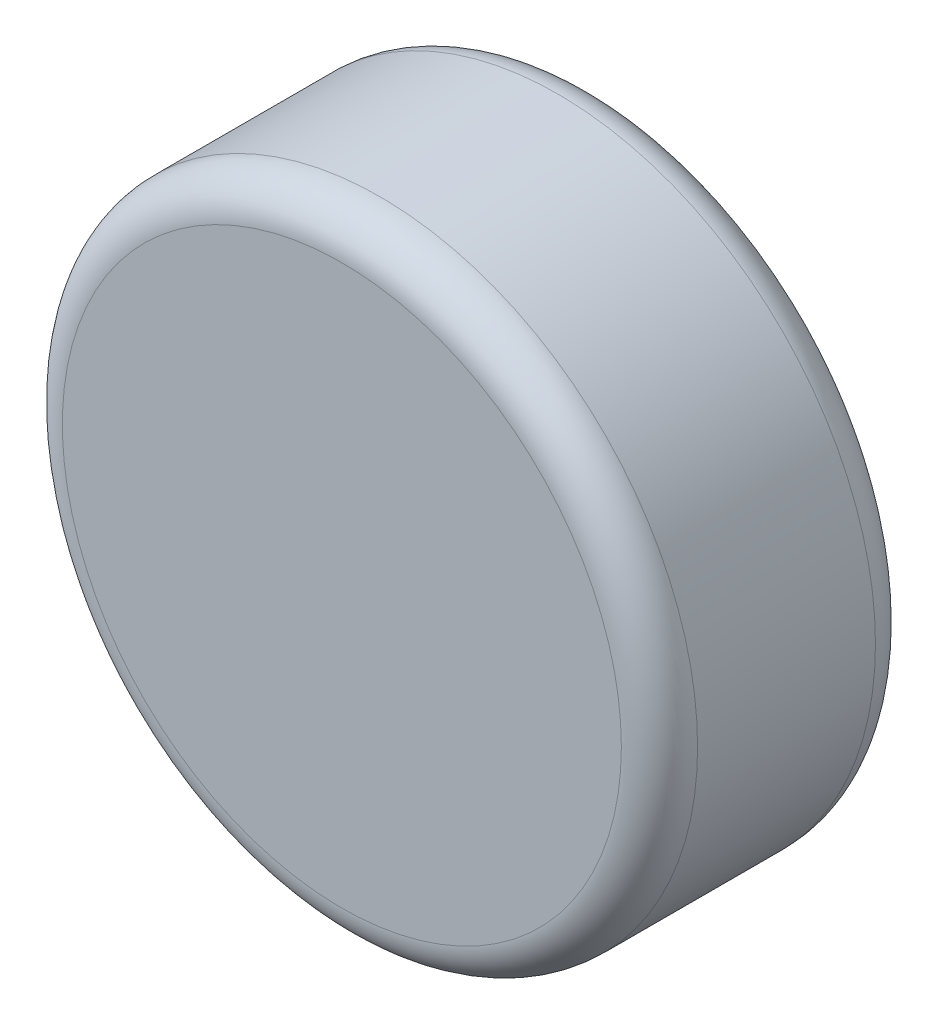
ISO-10303-21;
HEADER;
FILE_DESCRIPTION(('STEP AP214'),'2;1');
FILE_NAME('part.step','',(''),(''),'','','');
FILE_SCHEMA(('AUTOMOTIVE_DESIGN { 1 0 10303 214 1 1 1 1 }'));
ENDSEC;
DATA;
#1=APPLICATION_CONTEXT('core data for automotive mechanical design processes');
#2=APPLICATION_PROTOCOL_DEFINITION('international standard','automotive_design',2000,#1);
#3=PRODUCT_CONTEXT('',#1,'mechanical');
#4=PRODUCT('Part','Part','',(#3));
#5=PRODUCT_RELATED_PRODUCT_CATEGORY('part','',(#4));
#6=PRODUCT_DEFINITION_FORMATION('','',#4);
#7=PRODUCT_DEFINITION_CONTEXT('part definition',#1,'design');
#8=PRODUCT_DEFINITION('design','',#6,#7);
#9=PRODUCT_DEFINITION_SHAPE('','',#8);
#10=(LENGTH_UNIT() NAMED_UNIT(*) SI_UNIT(.MILLI.,.METRE.));
#11=(NAMED_UNIT(*) PLANE_ANGLE_UNIT() SI_UNIT($,.RADIAN.));
#12=(NAMED_UNIT(*) SI_UNIT($,.STERADIAN.) SOLID_ANGLE_UNIT());
#13=UNCERTAINTY_MEASURE_WITH_UNIT(LENGTH_MEASURE(1.E-05),#10,'distance_accuracy_value','');
#14=(GEOMETRIC_REPRESENTATION_CONTEXT(3) GLOBAL_UNCERTAINTY_ASSIGNED_CONTEXT((#13)) GLOBAL_UNIT_ASSIGNED_CONTEXT((#10,
#11,#12)) REPRESENTATION_CONTEXT('',''));
#15=CARTESIAN_POINT('',(0.,0.,0.));
#16=DIRECTION('',(0.,0.,1.));
#17=DIRECTION('',(1.,0.,0.));
#18=AXIS2_PLACEMENT_3D('',#15,#16,#17);
#19=CARTESIAN_POINT('',(0.,0.,2.));
#20=DIRECTION('',(0.,0.,-1.));
#21=DIRECTION('',(-1.,0.,0.));
#22=AXIS2_PLACEMENT_3D('',#19,#20,#21);
#23=CYLINDRICAL_SURFACE('',#22,2.5);
#24=CARTESIAN_POINT('',(0.,0.,0.3));
#25=DIRECTION('',(0.,0.,1.));
#26=DIRECTION('',(1.,0.,0.));
#27=AXIS2_PLACEMENT_3D('',#24,#25,#26);
#28=CIRCLE('',#27,2.5);
#29=CARTESIAN_POINT('',(2.5,0.,0.3));
#30=VERTEX_POINT('',#29);
#31=EDGE_CURVE('E54',#30,#30,#28,.T.);
#32=ORIENTED_EDGE('',*,*,#31,.T.);
#33=EDGE_LOOP('',(#32));
#34=FACE_BOUND('',#33,.T.);
#35=CARTESIAN_POINT('',(0.,0.,1.7));
#36=DIRECTION('',(0.,0.,1.));
#37=DIRECTION('',(1.,0.,0.));
#38=AXIS2_PLACEMENT_3D('',#35,#36,#37);
#39=CIRCLE('',#38,2.5);
#40=CARTESIAN_POINT('',(2.5,0.,1.7));
#41=VERTEX_POINT('',#40);
#42=EDGE_CURVE('E59',#41,#41,#39,.F.);
#43=ORIENTED_EDGE('',*,*,#42,.T.);
#44=EDGE_LOOP('',(#43));
#45=FACE_BOUND('',#44,.T.);
#46=ADVANCED_FACE('F41',(#34,#45),#23,.T.);
#47=CARTESIAN_POINT('',(0.,0.,2.));
#48=DIRECTION('',(0.,0.,1.));
#49=DIRECTION('',(1.,0.,0.));
#50=AXIS2_PLACEMENT_3D('',#47,#48,#49);
#51=PLANE('',#50);
#52=CARTESIAN_POINT('',(0.,0.,2.));
#53=DIRECTION('',(0.,0.,1.));
#54=DIRECTION('',(1.,0.,0.));
#55=AXIS2_PLACEMENT_3D('',#52,#53,#54);
#56=CIRCLE('',#55,2.2);
#57=CARTESIAN_POINT('',(2.2,0.,2.));
#58=VERTEX_POINT('',#57);
#59=EDGE_CURVE('E10',#58,#58,#56,.T.);
#60=ORIENTED_EDGE('',*,*,#59,.T.);
#61=EDGE_LOOP('',(#60));
#62=FACE_BOUND('',#61,.T.);
#63=ADVANCED_FACE('F76',(#62),#51,.T.);
#64=CARTESIAN_POINT('',(0.,0.,0.));
#65=DIRECTION('',(0.,0.,1.));
#66=DIRECTION('',(1.,0.,0.));
#67=AXIS2_PLACEMENT_3D('',#64,#65,#66);
#68=PLANE('',#67);
#69=CARTESIAN_POINT('',(0.,0.,0.));
#70=DIRECTION('',(0.,0.,1.));
#71=DIRECTION('',(1.,0.,0.));
#72=AXIS2_PLACEMENT_3D('',#69,#70,#71);
#73=CIRCLE('',#72,2.2);
#74=CARTESIAN_POINT('',(2.2,0.,0.));
#75=VERTEX_POINT('',#74);
#76=EDGE_CURVE('E49',#75,#75,#73,.F.);
#77=ORIENTED_EDGE('',*,*,#76,.T.);
#78=EDGE_LOOP('',(#77));
#79=FACE_BOUND('',#78,.T.);
#80=ADVANCED_FACE('F73',(#79),#68,.F.);
#81=CARTESIAN_POINT('',(0.,0.,0.3));
#82=DIRECTION('',(0.,0.,1.));
#83=DIRECTION('',(1.,0.,0.));
#84=AXIS2_PLACEMENT_3D('',#81,#82,#83);
#85=TOROIDAL_SURFACE('',#84,2.2,0.3);
#86=ORIENTED_EDGE('',*,*,#76,.F.);
#87=EDGE_LOOP('',(#86));
#88=FACE_BOUND('',#87,.T.);
#89=ORIENTED_EDGE('',*,*,#31,.F.);
#90=EDGE_LOOP('',(#89));
#91=FACE_BOUND('',#90,.T.);
#92=ADVANCED_FACE('F69',(#88,#91),#85,.T.);
#93=CARTESIAN_POINT('',(0.,0.,1.7));
#94=DIRECTION('',(0.,0.,1.));
#95=DIRECTION('',(1.,0.,0.));
#96=AXIS2_PLACEMENT_3D('',#93,#94,#95);
#97=TOROIDAL_SURFACE('',#96,2.2,0.3);
#98=ORIENTED_EDGE('',*,*,#42,.F.);
#99=EDGE_LOOP('',(#98));
#100=FACE_BOUND('',#99,.T.);
#101=ORIENTED_EDGE('',*,*,#59,.F.);
#102=EDGE_LOOP('',(#101));
#103=FACE_BOUND('',#102,.T.);
#104=ADVANCED_FACE('F43',(#100,#103),#97,.T.);
#105=CLOSED_SHELL('',(#46,#63,#80,#92,#104));
#106=MANIFOLD_SOLID_BREP('B2',#105);
#107=ADVANCED_BREP_SHAPE_REPRESENTATION('',(#18,#106),#14);
#108=SHAPE_DEFINITION_REPRESENTATION(#9,#107);
ENDSEC;
END-ISO-10303-21;
